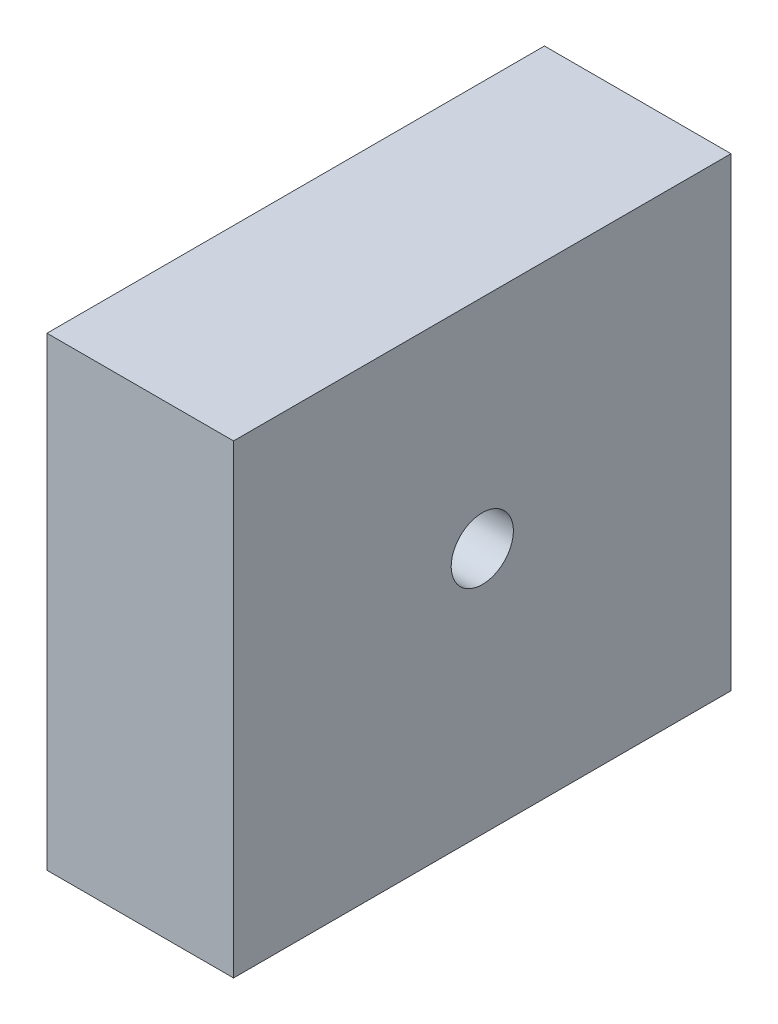
ISO-10303-21;
HEADER;
FILE_DESCRIPTION(('STEP AP214'),'2;1');
FILE_NAME('part.step','',(''),(''),'','','');
FILE_SCHEMA(('AUTOMOTIVE_DESIGN { 1 0 10303 214 1 1 1 1 }'));
ENDSEC;
DATA;
#1=APPLICATION_CONTEXT('core data for automotive mechanical design processes');
#2=APPLICATION_PROTOCOL_DEFINITION('international standard','automotive_design',2000,#1);
#3=PRODUCT_CONTEXT('',#1,'mechanical');
#4=PRODUCT('Part','Part','',(#3));
#5=PRODUCT_RELATED_PRODUCT_CATEGORY('part','',(#4));
#6=PRODUCT_DEFINITION_FORMATION('','',#4);
#7=PRODUCT_DEFINITION_CONTEXT('part definition',#1,'design');
#8=PRODUCT_DEFINITION('design','',#6,#7);
#9=PRODUCT_DEFINITION_SHAPE('','',#8);
#10=(LENGTH_UNIT() NAMED_UNIT(*) SI_UNIT(.MILLI.,.METRE.));
#11=(NAMED_UNIT(*) PLANE_ANGLE_UNIT() SI_UNIT($,.RADIAN.));
#12=(NAMED_UNIT(*) SI_UNIT($,.STERADIAN.) SOLID_ANGLE_UNIT());
#13=UNCERTAINTY_MEASURE_WITH_UNIT(LENGTH_MEASURE(1.E-05),#10,'distance_accuracy_value','');
#14=(GEOMETRIC_REPRESENTATION_CONTEXT(3) GLOBAL_UNCERTAINTY_ASSIGNED_CONTEXT((#13)) GLOBAL_UNIT_ASSIGNED_CONTEXT((#10,
#11,#12)) REPRESENTATION_CONTEXT('',''));
#15=CARTESIAN_POINT('',(0.,0.,0.));
#16=DIRECTION('',(0.,0.,1.));
#17=DIRECTION('',(1.,0.,0.));
#18=AXIS2_PLACEMENT_3D('',#15,#16,#17);
#19=CARTESIAN_POINT('',(9.52499999999999,47.498,-25.4));
#20=DIRECTION('',(-1.,0.,0.));
#21=DIRECTION('',(0.,0.,1.));
#22=AXIS2_PLACEMENT_3D('',#19,#20,#21);
#23=PLANE('',#22);
#24=CARTESIAN_POINT('',(9.525,25.2730000000001,0.));
#25=DIRECTION('',(-1.,0.,0.));
#26=DIRECTION('',(0.,0.,1.));
#27=AXIS2_PLACEMENT_3D('',#24,#25,#26);
#28=CIRCLE('',#27,3.175);
#29=CARTESIAN_POINT('',(9.525,25.2730000000001,3.17499999999999));
#30=VERTEX_POINT('',#29);
#31=EDGE_CURVE('E100',#30,#30,#28,.T.);
#32=ORIENTED_EDGE('',*,*,#31,.T.);
#33=EDGE_LOOP('',(#32));
#34=FACE_BOUND('',#33,.T.);
#35=DIRECTION('',(0.,0.,-1.));
#36=VECTOR('',#35,1.);
#37=CARTESIAN_POINT('',(9.52499999999999,0.,-25.4));
#38=LINE('',#37,#36);
#39=CARTESIAN_POINT('',(9.525,0.,25.4));
#40=VERTEX_POINT('',#39);
#41=CARTESIAN_POINT('',(9.52499999999999,0.,-25.4));
#42=VERTEX_POINT('',#41);
#43=EDGE_CURVE('E97',#40,#42,#38,.T.);
#44=ORIENTED_EDGE('',*,*,#43,.T.);
#45=DIRECTION('',(0.,-1.,0.));
#46=VECTOR('',#45,1.);
#47=CARTESIAN_POINT('',(9.52499999999999,47.498,-25.4));
#48=LINE('',#47,#46);
#49=CARTESIAN_POINT('',(9.52499999999999,47.498,-25.4));
#50=VERTEX_POINT('',#49);
#51=EDGE_CURVE('E11',#50,#42,#48,.T.);
#52=ORIENTED_EDGE('',*,*,#51,.F.);
#53=DIRECTION('',(0.,0.,-1.));
#54=VECTOR('',#53,1.);
#55=CARTESIAN_POINT('',(9.52499999999999,47.498,-25.4));
#56=LINE('',#55,#54);
#57=CARTESIAN_POINT('',(9.525,47.498,25.4));
#58=VERTEX_POINT('',#57);
#59=EDGE_CURVE('E85',#58,#50,#56,.T.);
#60=ORIENTED_EDGE('',*,*,#59,.F.);
#61=DIRECTION('',(0.,-1.,0.));
#62=VECTOR('',#61,1.);
#63=CARTESIAN_POINT('',(9.525,47.498,25.4));
#64=LINE('',#63,#62);
#65=EDGE_CURVE('E93',#58,#40,#64,.T.);
#66=ORIENTED_EDGE('',*,*,#65,.T.);
#67=EDGE_LOOP('',(#44,#52,#60,#66));
#68=FACE_BOUND('',#67,.T.);
#69=ADVANCED_FACE('F34',(#34,#68),#23,.F.);
#70=CARTESIAN_POINT('',(-9.52500000000001,47.498,-25.4));
#71=DIRECTION('',(0.,0.,1.));
#72=DIRECTION('',(1.,0.,0.));
#73=AXIS2_PLACEMENT_3D('',#70,#71,#72);
#74=PLANE('',#73);
#75=DIRECTION('',(-1.,0.,0.));
#76=VECTOR('',#75,1.);
#77=CARTESIAN_POINT('',(-9.52500000000001,0.,-25.4));
#78=LINE('',#77,#76);
#79=CARTESIAN_POINT('',(-9.52500000000001,0.,-25.4));
#80=VERTEX_POINT('',#79);
#81=EDGE_CURVE('E89',#42,#80,#78,.T.);
#82=ORIENTED_EDGE('',*,*,#81,.T.);
#83=DIRECTION('',(0.,-1.,0.));
#84=VECTOR('',#83,1.);
#85=CARTESIAN_POINT('',(-9.52500000000001,47.498,-25.4));
#86=LINE('',#85,#84);
#87=CARTESIAN_POINT('',(-9.52500000000001,47.498,-25.4));
#88=VERTEX_POINT('',#87);
#89=EDGE_CURVE('E42',#88,#80,#86,.T.);
#90=ORIENTED_EDGE('',*,*,#89,.F.);
#91=DIRECTION('',(-1.,0.,0.));
#92=VECTOR('',#91,1.);
#93=CARTESIAN_POINT('',(-9.52500000000001,47.498,-25.4));
#94=LINE('',#93,#92);
#95=EDGE_CURVE('E80',#50,#88,#94,.T.);
#96=ORIENTED_EDGE('',*,*,#95,.F.);
#97=ORIENTED_EDGE('',*,*,#51,.T.);
#98=EDGE_LOOP('',(#82,#90,#96,#97));
#99=FACE_BOUND('',#98,.T.);
#100=ADVANCED_FACE('F88',(#99),#74,.F.);
#101=CARTESIAN_POINT('',(-9.52500000000001,47.498,-25.4));
#102=DIRECTION('',(1.,0.,0.));
#103=DIRECTION('',(0.,0.,-1.));
#104=AXIS2_PLACEMENT_3D('',#101,#102,#103);
#105=PLANE('',#104);
#106=CARTESIAN_POINT('',(-9.52500000000001,25.2730000000001,0.));
#107=DIRECTION('',(-1.,0.,0.));
#108=DIRECTION('',(0.,0.,1.));
#109=AXIS2_PLACEMENT_3D('',#106,#107,#108);
#110=CIRCLE('',#109,3.175);
#111=CARTESIAN_POINT('',(-9.52500000000001,25.2730000000001,3.175));
#112=VERTEX_POINT('',#111);
#113=EDGE_CURVE('E113',#112,#112,#110,.T.);
#114=ORIENTED_EDGE('',*,*,#113,.F.);
#115=EDGE_LOOP('',(#114));
#116=FACE_BOUND('',#115,.T.);
#117=DIRECTION('',(0.,0.,1.));
#118=VECTOR('',#117,1.);
#119=CARTESIAN_POINT('',(-9.52500000000001,0.,-25.4));
#120=LINE('',#119,#118);
#121=CARTESIAN_POINT('',(-9.52500000000001,0.,25.4));
#122=VERTEX_POINT('',#121);
#123=EDGE_CURVE('E67',#80,#122,#120,.T.);
#124=ORIENTED_EDGE('',*,*,#123,.T.);
#125=DIRECTION('',(0.,-1.,0.));
#126=VECTOR('',#125,1.);
#127=CARTESIAN_POINT('',(-9.52500000000001,47.498,25.4));
#128=LINE('',#127,#126);
#129=CARTESIAN_POINT('',(-9.52500000000001,47.498,25.4));
#130=VERTEX_POINT('',#129);
#131=EDGE_CURVE('E90',#130,#122,#128,.T.);
#132=ORIENTED_EDGE('',*,*,#131,.F.);
#133=DIRECTION('',(0.,0.,1.));
#134=VECTOR('',#133,1.);
#135=CARTESIAN_POINT('',(-9.52500000000001,47.498,-25.4));
#136=LINE('',#135,#134);
#137=EDGE_CURVE('E83',#88,#130,#136,.T.);
#138=ORIENTED_EDGE('',*,*,#137,.F.);
#139=ORIENTED_EDGE('',*,*,#89,.T.);
#140=EDGE_LOOP('',(#124,#132,#138,#139));
#141=FACE_BOUND('',#140,.T.);
#142=ADVANCED_FACE('F91',(#116,#141),#105,.F.);
#143=CARTESIAN_POINT('',(-9.52500000000001,47.498,25.4));
#144=DIRECTION('',(0.,0.,-1.));
#145=DIRECTION('',(-1.,0.,0.));
#146=AXIS2_PLACEMENT_3D('',#143,#144,#145);
#147=PLANE('',#146);
#148=DIRECTION('',(1.,0.,0.));
#149=VECTOR('',#148,1.);
#150=CARTESIAN_POINT('',(-9.52500000000001,0.,25.4));
#151=LINE('',#150,#149);
#152=EDGE_CURVE('E73',#122,#40,#151,.T.);
#153=ORIENTED_EDGE('',*,*,#152,.T.);
#154=ORIENTED_EDGE('',*,*,#65,.F.);
#155=DIRECTION('',(1.,0.,0.));
#156=VECTOR('',#155,1.);
#157=CARTESIAN_POINT('',(-9.52500000000001,47.498,25.4));
#158=LINE('',#157,#156);
#159=EDGE_CURVE('E50',#130,#58,#158,.T.);
#160=ORIENTED_EDGE('',*,*,#159,.F.);
#161=ORIENTED_EDGE('',*,*,#131,.T.);
#162=EDGE_LOOP('',(#153,#154,#160,#161));
#163=FACE_BOUND('',#162,.T.);
#164=ADVANCED_FACE('F105',(#163),#147,.F.);
#165=CARTESIAN_POINT('',(0.,47.498,0.));
#166=DIRECTION('',(0.,1.,0.));
#167=DIRECTION('',(0.,0.,1.));
#168=AXIS2_PLACEMENT_3D('',#165,#166,#167);
#169=PLANE('',#168);
#170=ORIENTED_EDGE('',*,*,#59,.T.);
#171=ORIENTED_EDGE('',*,*,#95,.T.);
#172=ORIENTED_EDGE('',*,*,#137,.T.);
#173=ORIENTED_EDGE('',*,*,#159,.T.);
#174=EDGE_LOOP('',(#170,#171,#172,#173));
#175=FACE_BOUND('',#174,.T.);
#176=ADVANCED_FACE('F81',(#175),#169,.T.);
#177=CARTESIAN_POINT('',(0.,0.,0.));
#178=DIRECTION('',(0.,1.,0.));
#179=DIRECTION('',(0.,0.,1.));
#180=AXIS2_PLACEMENT_3D('',#177,#178,#179);
#181=PLANE('',#180);
#182=ORIENTED_EDGE('',*,*,#43,.F.);
#183=ORIENTED_EDGE('',*,*,#152,.F.);
#184=ORIENTED_EDGE('',*,*,#123,.F.);
#185=ORIENTED_EDGE('',*,*,#81,.F.);
#186=EDGE_LOOP('',(#182,#183,#184,#185));
#187=FACE_BOUND('',#186,.T.);
#188=ADVANCED_FACE('F108',(#187),#181,.F.);
#189=CARTESIAN_POINT('',(-9.52500000000001,25.2730000000001,0.));
#190=DIRECTION('',(-1.,0.,0.));
#191=DIRECTION('',(0.,0.,1.));
#192=AXIS2_PLACEMENT_3D('',#189,#190,#191);
#193=CYLINDRICAL_SURFACE('',#192,3.175);
#194=ORIENTED_EDGE('',*,*,#31,.F.);
#195=EDGE_LOOP('',(#194));
#196=FACE_BOUND('',#195,.T.);
#197=ORIENTED_EDGE('',*,*,#113,.T.);
#198=EDGE_LOOP('',(#197));
#199=FACE_BOUND('',#198,.T.);
#200=ADVANCED_FACE('F117',(#196,#199),#193,.F.);
#201=CLOSED_SHELL('',(#69,#100,#142,#164,#176,#188,#200));
#202=MANIFOLD_SOLID_BREP('B2',#201);
#203=ADVANCED_BREP_SHAPE_REPRESENTATION('',(#18,#202),#14);
#204=SHAPE_DEFINITION_REPRESENTATION(#9,#203);
ENDSEC;
END-ISO-10303-21;
